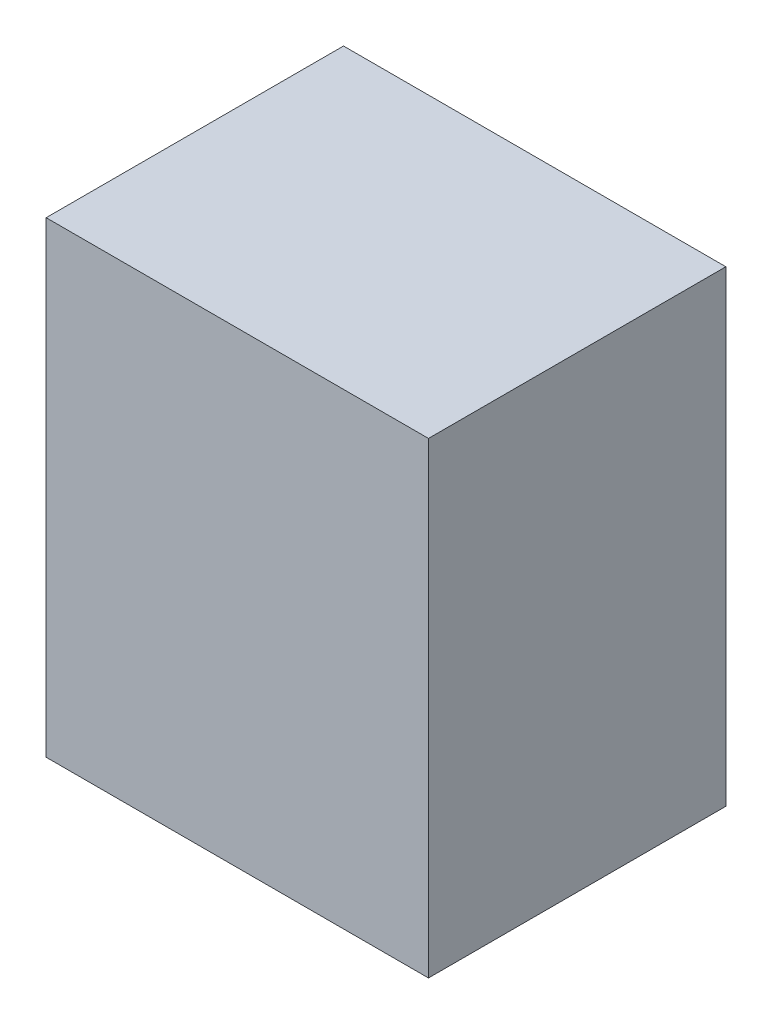
ISO-10303-21;
HEADER;
FILE_DESCRIPTION(('STEP AP214'),'2;1');
FILE_NAME('part.step','',(''),(''),'','','');
FILE_SCHEMA(('AUTOMOTIVE_DESIGN { 1 0 10303 214 1 1 1 1 }'));
ENDSEC;
DATA;
#1=APPLICATION_CONTEXT('core data for automotive mechanical design processes');
#2=APPLICATION_PROTOCOL_DEFINITION('international standard','automotive_design',2000,#1);
#3=PRODUCT_CONTEXT('',#1,'mechanical');
#4=PRODUCT('Part','Part','',(#3));
#5=PRODUCT_RELATED_PRODUCT_CATEGORY('part','',(#4));
#6=PRODUCT_DEFINITION_FORMATION('','',#4);
#7=PRODUCT_DEFINITION_CONTEXT('part definition',#1,'design');
#8=PRODUCT_DEFINITION('design','',#6,#7);
#9=PRODUCT_DEFINITION_SHAPE('','',#8);
#10=(LENGTH_UNIT() NAMED_UNIT(*) SI_UNIT(.MILLI.,.METRE.));
#11=(NAMED_UNIT(*) PLANE_ANGLE_UNIT() SI_UNIT($,.RADIAN.));
#12=(NAMED_UNIT(*) SI_UNIT($,.STERADIAN.) SOLID_ANGLE_UNIT());
#13=UNCERTAINTY_MEASURE_WITH_UNIT(LENGTH_MEASURE(1.E-05),#10,'distance_accuracy_value','');
#14=(GEOMETRIC_REPRESENTATION_CONTEXT(3) GLOBAL_UNCERTAINTY_ASSIGNED_CONTEXT((#13)) GLOBAL_UNIT_ASSIGNED_CONTEXT((#10,
#11,#12)) REPRESENTATION_CONTEXT('',''));
#15=CARTESIAN_POINT('',(0.,0.,0.));
#16=DIRECTION('',(0.,0.,1.));
#17=DIRECTION('',(1.,0.,0.));
#18=AXIS2_PLACEMENT_3D('',#15,#16,#17);
#19=CARTESIAN_POINT('',(-38.008536111433,31.9565217391304,70.));
#20=DIRECTION('',(1.,0.,0.));
#21=DIRECTION('',(0.,1.,0.));
#22=AXIS2_PLACEMENT_3D('',#19,#20,#21);
#23=PLANE('',#22);
#24=DIRECTION('',(0.,-1.,0.));
#25=VECTOR('',#24,1.);
#26=CARTESIAN_POINT('',(-38.008536111433,31.9565217391304,0.));
#27=LINE('',#26,#25);
#28=CARTESIAN_POINT('',(-38.008536111433,31.9565217391304,0.));
#29=VERTEX_POINT('',#28);
#30=CARTESIAN_POINT('',(-38.008536111433,-78.0434782608696,0.));
#31=VERTEX_POINT('',#30);
#32=EDGE_CURVE('E97',#29,#31,#27,.T.);
#33=ORIENTED_EDGE('',*,*,#32,.T.);
#34=DIRECTION('',(0.,0.,-1.));
#35=VECTOR('',#34,1.);
#36=CARTESIAN_POINT('',(-38.008536111433,-78.0434782608696,70.));
#37=LINE('',#36,#35);
#38=CARTESIAN_POINT('',(-38.008536111433,-78.0434782608696,70.));
#39=VERTEX_POINT('',#38);
#40=EDGE_CURVE('E11',#39,#31,#37,.T.);
#41=ORIENTED_EDGE('',*,*,#40,.F.);
#42=DIRECTION('',(0.,-1.,0.));
#43=VECTOR('',#42,1.);
#44=CARTESIAN_POINT('',(-38.008536111433,31.9565217391304,70.));
#45=LINE('',#44,#43);
#46=CARTESIAN_POINT('',(-38.008536111433,31.9565217391304,70.));
#47=VERTEX_POINT('',#46);
#48=EDGE_CURVE('E85',#47,#39,#45,.T.);
#49=ORIENTED_EDGE('',*,*,#48,.F.);
#50=DIRECTION('',(0.,0.,-1.));
#51=VECTOR('',#50,1.);
#52=CARTESIAN_POINT('',(-38.008536111433,31.9565217391304,70.));
#53=LINE('',#52,#51);
#54=EDGE_CURVE('E93',#47,#29,#53,.T.);
#55=ORIENTED_EDGE('',*,*,#54,.T.);
#56=EDGE_LOOP('',(#33,#41,#49,#55));
#57=FACE_BOUND('',#56,.T.);
#58=ADVANCED_FACE('F34',(#57),#23,.F.);
#59=CARTESIAN_POINT('',(-38.008536111433,-78.0434782608696,70.));
#60=DIRECTION('',(0.,1.,0.));
#61=DIRECTION('',(0.,0.,1.));
#62=AXIS2_PLACEMENT_3D('',#59,#60,#61);
#63=PLANE('',#62);
#64=DIRECTION('',(1.,0.,0.));
#65=VECTOR('',#64,1.);
#66=CARTESIAN_POINT('',(-38.008536111433,-78.0434782608696,0.));
#67=LINE('',#66,#65);
#68=CARTESIAN_POINT('',(51.991463888567,-78.0434782608696,0.));
#69=VERTEX_POINT('',#68);
#70=EDGE_CURVE('E89',#31,#69,#67,.T.);
#71=ORIENTED_EDGE('',*,*,#70,.T.);
#72=DIRECTION('',(0.,0.,-1.));
#73=VECTOR('',#72,1.);
#74=CARTESIAN_POINT('',(51.991463888567,-78.0434782608696,70.));
#75=LINE('',#74,#73);
#76=CARTESIAN_POINT('',(51.991463888567,-78.0434782608696,70.));
#77=VERTEX_POINT('',#76);
#78=EDGE_CURVE('E42',#77,#69,#75,.T.);
#79=ORIENTED_EDGE('',*,*,#78,.F.);
#80=DIRECTION('',(1.,0.,0.));
#81=VECTOR('',#80,1.);
#82=CARTESIAN_POINT('',(-38.008536111433,-78.0434782608696,70.));
#83=LINE('',#82,#81);
#84=EDGE_CURVE('E80',#39,#77,#83,.T.);
#85=ORIENTED_EDGE('',*,*,#84,.F.);
#86=ORIENTED_EDGE('',*,*,#40,.T.);
#87=EDGE_LOOP('',(#71,#79,#85,#86));
#88=FACE_BOUND('',#87,.T.);
#89=ADVANCED_FACE('F88',(#88),#63,.F.);
#90=CARTESIAN_POINT('',(51.9914638885669,31.9565217391304,70.));
#91=DIRECTION('',(-1.,0.,0.));
#92=DIRECTION('',(0.,-1.,0.));
#93=AXIS2_PLACEMENT_3D('',#90,#91,#92);
#94=PLANE('',#93);
#95=DIRECTION('',(0.,1.,0.));
#96=VECTOR('',#95,1.);
#97=CARTESIAN_POINT('',(51.9914638885669,31.9565217391304,0.));
#98=LINE('',#97,#96);
#99=CARTESIAN_POINT('',(51.9914638885669,31.9565217391304,0.));
#100=VERTEX_POINT('',#99);
#101=EDGE_CURVE('E67',#69,#100,#98,.T.);
#102=ORIENTED_EDGE('',*,*,#101,.T.);
#103=DIRECTION('',(0.,0.,-1.));
#104=VECTOR('',#103,1.);
#105=CARTESIAN_POINT('',(51.9914638885669,31.9565217391304,70.));
#106=LINE('',#105,#104);
#107=CARTESIAN_POINT('',(51.9914638885669,31.9565217391304,70.));
#108=VERTEX_POINT('',#107);
#109=EDGE_CURVE('E90',#108,#100,#106,.T.);
#110=ORIENTED_EDGE('',*,*,#109,.F.);
#111=DIRECTION('',(0.,1.,0.));
#112=VECTOR('',#111,1.);
#113=CARTESIAN_POINT('',(51.9914638885669,31.9565217391304,70.));
#114=LINE('',#113,#112);
#115=EDGE_CURVE('E83',#77,#108,#114,.T.);
#116=ORIENTED_EDGE('',*,*,#115,.F.);
#117=ORIENTED_EDGE('',*,*,#78,.T.);
#118=EDGE_LOOP('',(#102,#110,#116,#117));
#119=FACE_BOUND('',#118,.T.);
#120=ADVANCED_FACE('F91',(#119),#94,.F.);
#121=CARTESIAN_POINT('',(-38.008536111433,31.9565217391304,70.));
#122=DIRECTION('',(0.,-1.,0.));
#123=DIRECTION('',(0.,0.,-1.));
#124=AXIS2_PLACEMENT_3D('',#121,#122,#123);
#125=PLANE('',#124);
#126=DIRECTION('',(-1.,0.,0.));
#127=VECTOR('',#126,1.);
#128=CARTESIAN_POINT('',(-38.008536111433,31.9565217391304,0.));
#129=LINE('',#128,#127);
#130=EDGE_CURVE('E73',#100,#29,#129,.T.);
#131=ORIENTED_EDGE('',*,*,#130,.T.);
#132=ORIENTED_EDGE('',*,*,#54,.F.);
#133=DIRECTION('',(-1.,0.,0.));
#134=VECTOR('',#133,1.);
#135=CARTESIAN_POINT('',(-38.008536111433,31.9565217391304,70.));
#136=LINE('',#135,#134);
#137=EDGE_CURVE('E50',#108,#47,#136,.T.);
#138=ORIENTED_EDGE('',*,*,#137,.F.);
#139=ORIENTED_EDGE('',*,*,#109,.T.);
#140=EDGE_LOOP('',(#131,#132,#138,#139));
#141=FACE_BOUND('',#140,.T.);
#142=ADVANCED_FACE('F104',(#141),#125,.F.);
#143=CARTESIAN_POINT('',(0.,0.,70.));
#144=DIRECTION('',(0.,0.,1.));
#145=DIRECTION('',(1.,0.,0.));
#146=AXIS2_PLACEMENT_3D('',#143,#144,#145);
#147=PLANE('',#146);
#148=ORIENTED_EDGE('',*,*,#48,.T.);
#149=ORIENTED_EDGE('',*,*,#84,.T.);
#150=ORIENTED_EDGE('',*,*,#115,.T.);
#151=ORIENTED_EDGE('',*,*,#137,.T.);
#152=EDGE_LOOP('',(#148,#149,#150,#151));
#153=FACE_BOUND('',#152,.T.);
#154=ADVANCED_FACE('F81',(#153),#147,.T.);
#155=CARTESIAN_POINT('',(0.,0.,0.));
#156=DIRECTION('',(0.,0.,1.));
#157=DIRECTION('',(1.,0.,0.));
#158=AXIS2_PLACEMENT_3D('',#155,#156,#157);
#159=PLANE('',#158);
#160=ORIENTED_EDGE('',*,*,#32,.F.);
#161=ORIENTED_EDGE('',*,*,#130,.F.);
#162=ORIENTED_EDGE('',*,*,#101,.F.);
#163=ORIENTED_EDGE('',*,*,#70,.F.);
#164=EDGE_LOOP('',(#160,#161,#162,#163));
#165=FACE_BOUND('',#164,.T.);
#166=ADVANCED_FACE('F107',(#165),#159,.F.);
#167=CLOSED_SHELL('',(#58,#89,#120,#142,#154,#166));
#168=MANIFOLD_SOLID_BREP('B2',#167);
#169=ADVANCED_BREP_SHAPE_REPRESENTATION('',(#18,#168),#14);
#170=SHAPE_DEFINITION_REPRESENTATION(#9,#169);
ENDSEC;
END-ISO-10303-21;
